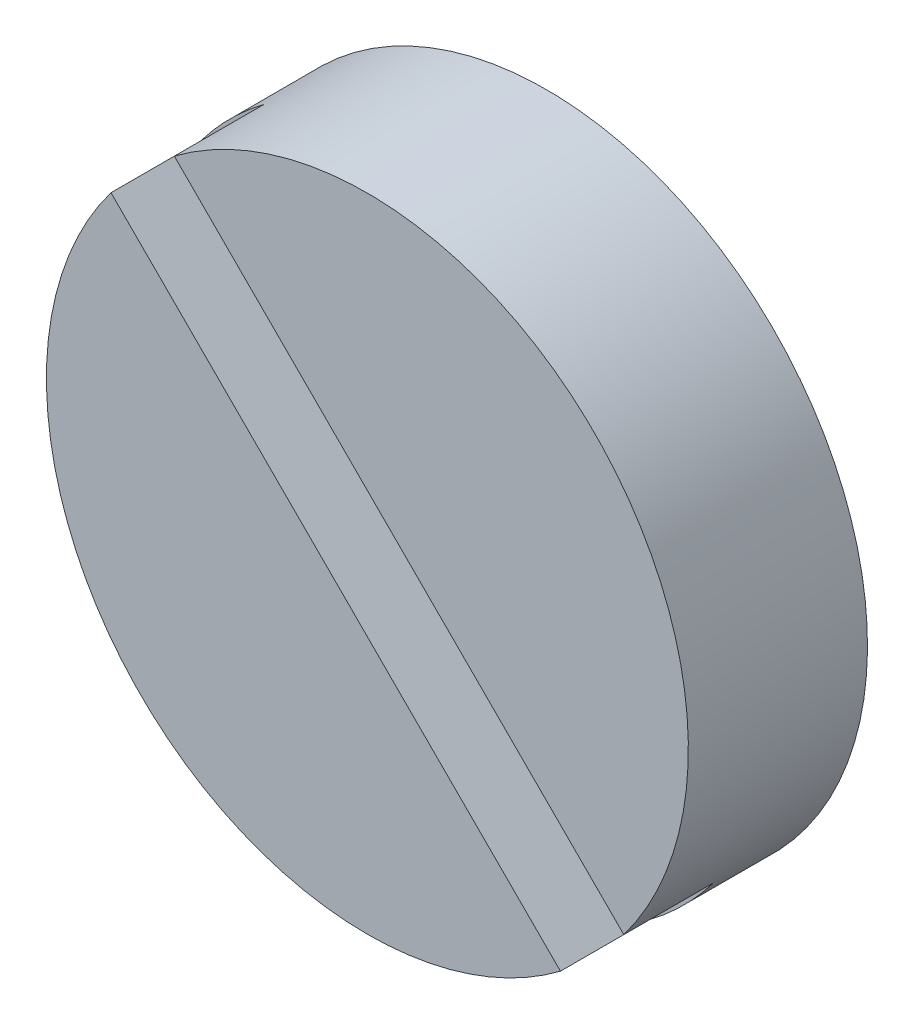
ISO-10303-21;
HEADER;
FILE_DESCRIPTION(('STEP AP214'),'2;1');
FILE_NAME('part.step','',(''),(''),'','','');
FILE_SCHEMA(('AUTOMOTIVE_DESIGN { 1 0 10303 214 1 1 1 1 }'));
ENDSEC;
DATA;
#1=APPLICATION_CONTEXT('core data for automotive mechanical design processes');
#2=APPLICATION_PROTOCOL_DEFINITION('international standard','automotive_design',2000,#1);
#3=PRODUCT_CONTEXT('',#1,'mechanical');
#4=PRODUCT('Part','Part','',(#3));
#5=PRODUCT_RELATED_PRODUCT_CATEGORY('part','',(#4));
#6=PRODUCT_DEFINITION_FORMATION('','',#4);
#7=PRODUCT_DEFINITION_CONTEXT('part definition',#1,'design');
#8=PRODUCT_DEFINITION('design','',#6,#7);
#9=PRODUCT_DEFINITION_SHAPE('','',#8);
#10=(LENGTH_UNIT() NAMED_UNIT(*) SI_UNIT(.MILLI.,.METRE.));
#11=(NAMED_UNIT(*) PLANE_ANGLE_UNIT() SI_UNIT($,.RADIAN.));
#12=(NAMED_UNIT(*) SI_UNIT($,.STERADIAN.) SOLID_ANGLE_UNIT());
#13=UNCERTAINTY_MEASURE_WITH_UNIT(LENGTH_MEASURE(1.E-05),#10,'distance_accuracy_value','');
#14=(GEOMETRIC_REPRESENTATION_CONTEXT(3) GLOBAL_UNCERTAINTY_ASSIGNED_CONTEXT((#13)) GLOBAL_UNIT_ASSIGNED_CONTEXT((#10,
#11,#12)) REPRESENTATION_CONTEXT('',''));
#15=CARTESIAN_POINT('',(0.,0.,0.));
#16=DIRECTION('',(0.,0.,1.));
#17=DIRECTION('',(1.,0.,0.));
#18=AXIS2_PLACEMENT_3D('',#15,#16,#17);
#19=CARTESIAN_POINT('',(49.7387324650882,44.6422521676476,49.3014));
#20=DIRECTION('',(0.707106781186547,0.707106781186547,0.));
#21=DIRECTION('',(0.,0.,-1.));
#22=AXIS2_PLACEMENT_3D('',#19,#20,#21);
#23=PLANE('',#22);
#24=DIRECTION('',(0.,0.,1.));
#25=VECTOR('',#24,1.);
#26=CARTESIAN_POINT('',(45.5326255257677,48.848359106968,48.8442));
#27=LINE('',#26,#25);
#28=CARTESIAN_POINT('',(45.5326255257677,48.848359106968,48.4632));
#29=VERTEX_POINT('',#28);
#30=CARTESIAN_POINT('',(45.5326255257677,48.848359106968,49.2252));
#31=VERTEX_POINT('',#30);
#32=EDGE_CURVE('E79',#29,#31,#27,.T.);
#33=ORIENTED_EDGE('',*,*,#32,.T.);
#34=DIRECTION('',(-0.707106781186547,0.707106781186548,0.));
#35=VECTOR('',#34,1.);
#36=CARTESIAN_POINT('',(47.4444923163679,46.9364923163679,49.2252));
#37=LINE('',#36,#35);
#38=CARTESIAN_POINT('',(49.356359106968,45.0246255257677,49.2252));
#39=VERTEX_POINT('',#38);
#40=EDGE_CURVE('E81',#39,#31,#37,.T.);
#41=ORIENTED_EDGE('',*,*,#40,.F.);
#42=DIRECTION('',(0.,0.,-1.));
#43=VECTOR('',#42,1.);
#44=CARTESIAN_POINT('',(49.356359106968,45.0246255257677,48.8442));
#45=LINE('',#44,#43);
#46=CARTESIAN_POINT('',(49.356359106968,45.0246255257677,48.4632));
#47=VERTEX_POINT('',#46);
#48=EDGE_CURVE('E82',#39,#47,#45,.T.);
#49=ORIENTED_EDGE('',*,*,#48,.T.);
#50=DIRECTION('',(0.707106781186548,-0.707106781186548,0.));
#51=VECTOR('',#50,1.);
#52=CARTESIAN_POINT('',(47.4444923163679,46.9364923163679,48.4632));
#53=LINE('',#52,#51);
#54=EDGE_CURVE('E66',#29,#47,#53,.T.);
#55=ORIENTED_EDGE('',*,*,#54,.F.);
#56=EDGE_LOOP('',(#33,#41,#49,#55));
#57=FACE_BOUND('',#56,.T.);
#58=ADVANCED_FACE('F17',(#57),#23,.T.);
#59=CARTESIAN_POINT('',(41.9247355157471,46.6625874624914,49.2252));
#60=DIRECTION('',(0.,0.,1.));
#61=DIRECTION('',(0.707106781186547,-0.707106781186547,0.));
#62=AXIS2_PLACEMENT_3D('',#59,#60,#61);
#63=PLANE('',#62);
#64=ORIENTED_EDGE('',*,*,#40,.T.);
#65=CARTESIAN_POINT('',(47.7139,47.2059,49.2252));
#66=DIRECTION('',(0.,0.,1.));
#67=DIRECTION('',(0.,-1.,0.));
#68=AXIS2_PLACEMENT_3D('',#65,#66,#67);
#69=CIRCLE('',#68,2.73049999999986);
#70=EDGE_CURVE('E67',#39,#31,#69,.F.);
#71=ORIENTED_EDGE('',*,*,#70,.F.);
#72=EDGE_LOOP('',(#64,#71));
#73=FACE_BOUND('',#72,.T.);
#74=ADVANCED_FACE('F91',(#73),#63,.T.);
#75=CARTESIAN_POINT('',(52.9489587381575,47.2059,48.4632));
#76=DIRECTION('',(0.,0.,1.));
#77=DIRECTION('',(-0.707106781186548,0.707106781186547,0.));
#78=AXIS2_PLACEMENT_3D('',#75,#76,#77);
#79=PLANE('',#78);
#80=ORIENTED_EDGE('',*,*,#54,.T.);
#81=CARTESIAN_POINT('',(47.7139,47.2059,48.4632));
#82=DIRECTION('',(0.,0.,1.));
#83=DIRECTION('',(0.,-1.,0.));
#84=AXIS2_PLACEMENT_3D('',#81,#82,#83);
#85=CIRCLE('',#84,2.73049999999986);
#86=CARTESIAN_POINT('',(49.8951744742322,45.5634408930318,48.4632));
#87=VERTEX_POINT('',#86);
#88=EDGE_CURVE('E21',#87,#47,#85,.F.);
#89=ORIENTED_EDGE('',*,*,#88,.F.);
#90=DIRECTION('',(0.707106781186527,-0.707106781186568,0.));
#91=VECTOR('',#90,1.);
#92=CARTESIAN_POINT('',(47.983307683632,47.4753076836321,48.4632));
#93=LINE('',#92,#91);
#94=CARTESIAN_POINT('',(46.0714408930319,49.3871744742323,48.4632));
#95=VERTEX_POINT('',#94);
#96=EDGE_CURVE('E63',#95,#87,#93,.T.);
#97=ORIENTED_EDGE('',*,*,#96,.F.);
#98=CARTESIAN_POINT('',(47.7139,47.2059,48.4632));
#99=DIRECTION('',(0.,0.,1.));
#100=DIRECTION('',(0.,-1.,0.));
#101=AXIS2_PLACEMENT_3D('',#98,#99,#100);
#102=CIRCLE('',#101,2.73049999999986);
#103=EDGE_CURVE('E56',#29,#95,#102,.F.);
#104=ORIENTED_EDGE('',*,*,#103,.F.);
#105=EDGE_LOOP('',(#80,#89,#97,#104));
#106=FACE_BOUND('',#105,.T.);
#107=ADVANCED_FACE('F62',(#106),#79,.T.);
#108=CARTESIAN_POINT('',(50.2775478323522,45.1810675349118,48.387));
#109=DIRECTION('',(-0.707106781186567,-0.707106781186528,0.));
#110=DIRECTION('',(0.,0.,1.));
#111=AXIS2_PLACEMENT_3D('',#108,#109,#110);
#112=PLANE('',#111);
#113=DIRECTION('',(0.,0.,-1.));
#114=VECTOR('',#113,1.);
#115=CARTESIAN_POINT('',(46.0714408930318,49.3871744742324,48.8442));
#116=LINE('',#115,#114);
#117=CARTESIAN_POINT('',(46.0714408930318,49.3871744742323,49.2252));
#118=VERTEX_POINT('',#117);
#119=EDGE_CURVE('E71',#118,#95,#116,.T.);
#120=ORIENTED_EDGE('',*,*,#119,.T.);
#121=ORIENTED_EDGE('',*,*,#96,.T.);
#122=DIRECTION('',(0.,0.,1.));
#123=VECTOR('',#122,1.);
#124=CARTESIAN_POINT('',(49.8951744742323,45.5634408930317,48.8442));
#125=LINE('',#124,#123);
#126=CARTESIAN_POINT('',(49.8951744742322,45.5634408930318,49.2252));
#127=VERTEX_POINT('',#126);
#128=EDGE_CURVE('E36',#87,#127,#125,.T.);
#129=ORIENTED_EDGE('',*,*,#128,.T.);
#130=DIRECTION('',(0.707106781186547,-0.707106781186547,0.));
#131=VECTOR('',#130,1.);
#132=CARTESIAN_POINT('',(47.983307683632,47.475307683632,49.2252));
#133=LINE('',#132,#131);
#134=EDGE_CURVE('E74',#118,#127,#133,.T.);
#135=ORIENTED_EDGE('',*,*,#134,.F.);
#136=EDGE_LOOP('',(#120,#121,#129,#135));
#137=FACE_BOUND('',#136,.T.);
#138=ADVANCED_FACE('F73',(#137),#112,.T.);
#139=CARTESIAN_POINT('',(47.7139,40.6939051461275,47.7012));
#140=DIRECTION('',(0.,0.,-1.));
#141=DIRECTION('',(-0.707106781186547,0.707106781186548,0.));
#142=AXIS2_PLACEMENT_3D('',#139,#140,#141);
#143=PLANE('',#142);
#144=CARTESIAN_POINT('',(47.7139,47.2059,47.7012));
#145=DIRECTION('',(0.,0.,1.));
#146=DIRECTION('',(0.,-1.,0.));
#147=AXIS2_PLACEMENT_3D('',#144,#145,#146);
#148=CIRCLE('',#147,2.73049999999986);
#149=CARTESIAN_POINT('',(47.7139,44.4754000000001,47.7012));
#150=VERTEX_POINT('',#149);
#151=EDGE_CURVE('E27',#150,#150,#148,.T.);
#152=ORIENTED_EDGE('',*,*,#151,.F.);
#153=EDGE_LOOP('',(#152));
#154=FACE_BOUND('',#153,.T.);
#155=ADVANCED_FACE('F107',(#154),#143,.T.);
#156=CARTESIAN_POINT('',(43.0113605907644,47.7492125375086,49.2252));
#157=DIRECTION('',(0.,0.,1.));
#158=DIRECTION('',(0.707106781186547,-0.707106781186547,0.));
#159=AXIS2_PLACEMENT_3D('',#156,#157,#158);
#160=PLANE('',#159);
#161=ORIENTED_EDGE('',*,*,#134,.T.);
#162=CARTESIAN_POINT('',(47.7139,47.2059,49.2252));
#163=DIRECTION('',(0.,0.,1.));
#164=DIRECTION('',(0.,-1.,0.));
#165=AXIS2_PLACEMENT_3D('',#162,#163,#164);
#166=CIRCLE('',#165,2.73049999999986);
#167=EDGE_CURVE('E11',#118,#127,#166,.F.);
#168=ORIENTED_EDGE('',*,*,#167,.F.);
#169=EDGE_LOOP('',(#161,#168));
#170=FACE_BOUND('',#169,.T.);
#171=ADVANCED_FACE('F19',(#170),#160,.T.);
#172=CARTESIAN_POINT('',(47.7139,47.2059,49.2252));
#173=DIRECTION('',(0.,0.,1.));
#174=DIRECTION('',(0.,-1.,0.));
#175=AXIS2_PLACEMENT_3D('',#172,#173,#174);
#176=CYLINDRICAL_SURFACE('',#175,2.73049999999986);
#177=ORIENTED_EDGE('',*,*,#128,.F.);
#178=ORIENTED_EDGE('',*,*,#88,.T.);
#179=ORIENTED_EDGE('',*,*,#48,.F.);
#180=ORIENTED_EDGE('',*,*,#70,.T.);
#181=ORIENTED_EDGE('',*,*,#32,.F.);
#182=ORIENTED_EDGE('',*,*,#103,.T.);
#183=ORIENTED_EDGE('',*,*,#119,.F.);
#184=ORIENTED_EDGE('',*,*,#167,.T.);
#185=EDGE_LOOP('',(#177,#178,#179,#180,#181,#182,#183,#184));
#186=FACE_BOUND('',#185,.T.);
#187=ORIENTED_EDGE('',*,*,#151,.T.);
#188=EDGE_LOOP('',(#187));
#189=FACE_BOUND('',#188,.T.);
#190=ADVANCED_FACE('F68',(#186,#189),#176,.T.);
#191=CLOSED_SHELL('',(#58,#74,#107,#138,#155,#171,#190));
#192=MANIFOLD_SOLID_BREP('B1',#191);
#193=ADVANCED_BREP_SHAPE_REPRESENTATION('',(#18,#192),#14);
#194=SHAPE_DEFINITION_REPRESENTATION(#9,#193);
ENDSEC;
END-ISO-10303-21;
